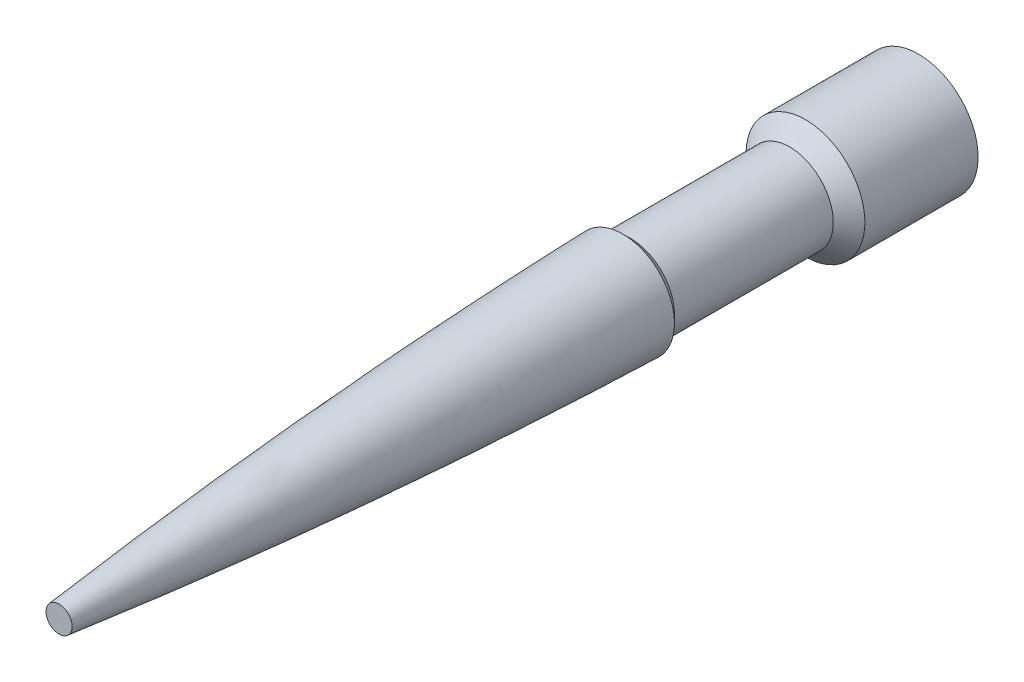
ISO-10303-21;
HEADER;
FILE_DESCRIPTION(('STEP AP214'),'2;1');
FILE_NAME('part.step','',(''),(''),'','','');
FILE_SCHEMA(('AUTOMOTIVE_DESIGN { 1 0 10303 214 1 1 1 1 }'));
ENDSEC;
DATA;
#1=APPLICATION_CONTEXT('core data for automotive mechanical design processes');
#2=APPLICATION_PROTOCOL_DEFINITION('international standard','automotive_design',2000,#1);
#3=PRODUCT_CONTEXT('',#1,'mechanical');
#4=PRODUCT('Part','Part','',(#3));
#5=PRODUCT_RELATED_PRODUCT_CATEGORY('part','',(#4));
#6=PRODUCT_DEFINITION_FORMATION('','',#4);
#7=PRODUCT_DEFINITION_CONTEXT('part definition',#1,'design');
#8=PRODUCT_DEFINITION('design','',#6,#7);
#9=PRODUCT_DEFINITION_SHAPE('','',#8);
#10=(LENGTH_UNIT() NAMED_UNIT(*) SI_UNIT(.MILLI.,.METRE.));
#11=(NAMED_UNIT(*) PLANE_ANGLE_UNIT() SI_UNIT($,.RADIAN.));
#12=(NAMED_UNIT(*) SI_UNIT($,.STERADIAN.) SOLID_ANGLE_UNIT());
#13=UNCERTAINTY_MEASURE_WITH_UNIT(LENGTH_MEASURE(1.E-05),#10,'distance_accuracy_value','');
#14=(GEOMETRIC_REPRESENTATION_CONTEXT(3) GLOBAL_UNCERTAINTY_ASSIGNED_CONTEXT((#13)) GLOBAL_UNIT_ASSIGNED_CONTEXT((#10,
#11,#12)) REPRESENTATION_CONTEXT('',''));
#15=CARTESIAN_POINT('',(0.,0.,0.));
#16=DIRECTION('',(0.,0.,1.));
#17=DIRECTION('',(1.,0.,0.));
#18=AXIS2_PLACEMENT_3D('',#15,#16,#17);
#19=CARTESIAN_POINT('',(0.,0.,0.));
#20=DIRECTION('',(0.,0.,1.));
#21=DIRECTION('',(1.,0.,0.));
#22=AXIS2_PLACEMENT_3D('',#19,#20,#21);
#23=PLANE('',#22);
#24=CARTESIAN_POINT('',(0.,0.,0.));
#25=DIRECTION('',(0.,0.,-1.));
#26=DIRECTION('',(-1.,0.,0.));
#27=AXIS2_PLACEMENT_3D('',#24,#25,#26);
#28=CIRCLE('',#27,7.49999999999998);
#29=CARTESIAN_POINT('',(-7.49999999999998,0.,0.));
#30=VERTEX_POINT('',#29);
#31=EDGE_CURVE('E75',#30,#30,#28,.T.);
#32=ORIENTED_EDGE('',*,*,#31,.T.);
#33=EDGE_LOOP('',(#32));
#34=FACE_BOUND('',#33,.T.);
#35=ADVANCED_FACE('F47',(#34),#23,.F.);
#36=CARTESIAN_POINT('',(0.,0.,108.493072776835));
#37=DIRECTION('',(0.,0.,-1.));
#38=DIRECTION('',(-1.,0.,0.));
#39=AXIS2_PLACEMENT_3D('',#36,#37,#38);
#40=PLANE('',#39);
#41=CARTESIAN_POINT('',(0.,0.,108.493072776835));
#42=DIRECTION('',(0.,0.,-1.));
#43=DIRECTION('',(-1.,0.,0.));
#44=AXIS2_PLACEMENT_3D('',#41,#42,#43);
#45=CIRCLE('',#44,1.64796304543771);
#46=CARTESIAN_POINT('',(-1.64796304543771,0.,108.493072776835));
#47=VERTEX_POINT('',#46);
#48=EDGE_CURVE('E10',#47,#47,#45,.T.);
#49=ORIENTED_EDGE('',*,*,#48,.F.);
#50=EDGE_LOOP('',(#49));
#51=FACE_BOUND('',#50,.T.);
#52=ADVANCED_FACE('F89',(#51),#40,.F.);
#53=CARTESIAN_POINT('',(1.64796304543771,0.,108.493072776835));
#54=CARTESIAN_POINT('',(5.54524245557787,0.,73.0165339564113));
#55=CARTESIAN_POINT('',(6.50411677118534,0.,37.3305737939415));
#56=B_SPLINE_CURVE_WITH_KNOTS('',2,(#53,#54,#55),.UNSPECIFIED.,.F.,.F.,(3,3),(0.,1.),.UNSPECIFIED.);
#57=CARTESIAN_POINT('',(0.,0.,0.));
#58=DIRECTION('',(0.,0.,-1.));
#59=AXIS1_PLACEMENT('',#57,#58);
#60=SURFACE_OF_REVOLUTION('',#56,#59);
#61=CARTESIAN_POINT('',(0.,0.,37.3305737939415));
#62=DIRECTION('',(0.,0.,-1.));
#63=DIRECTION('',(-1.,0.,0.));
#64=AXIS2_PLACEMENT_3D('',#61,#62,#63);
#65=CIRCLE('',#64,6.50411677118534);
#66=CARTESIAN_POINT('',(-6.50411677118534,0.,37.3305737939415));
#67=VERTEX_POINT('',#66);
#68=EDGE_CURVE('E54',#67,#67,#65,.T.);
#69=ORIENTED_EDGE('',*,*,#68,.F.);
#70=EDGE_LOOP('',(#69));
#71=FACE_BOUND('',#70,.T.);
#72=ORIENTED_EDGE('',*,*,#48,.T.);
#73=EDGE_LOOP('',(#72));
#74=FACE_BOUND('',#73,.T.);
#75=ADVANCED_FACE('F85',(#71,#74),#60,.T.);
#76=CARTESIAN_POINT('',(0.,0.,37.3305737939415));
#77=DIRECTION('',(0.,0.,1.));
#78=DIRECTION('',(1.,0.,0.));
#79=AXIS2_PLACEMENT_3D('',#76,#77,#78);
#80=CONICAL_SURFACE('',#79,6.50411677118534,0.785398163397434);
#81=CARTESIAN_POINT('',(0.,0.,36.3346905651269));
#82=DIRECTION('',(0.,0.,-1.));
#83=DIRECTION('',(-1.,0.,0.));
#84=AXIS2_PLACEMENT_3D('',#81,#82,#83);
#85=CIRCLE('',#84,5.50823354237079);
#86=CARTESIAN_POINT('',(-5.50823354237079,0.,36.3346905651269));
#87=VERTEX_POINT('',#86);
#88=EDGE_CURVE('E61',#87,#87,#85,.T.);
#89=ORIENTED_EDGE('',*,*,#88,.F.);
#90=EDGE_LOOP('',(#89));
#91=FACE_BOUND('',#90,.T.);
#92=ORIENTED_EDGE('',*,*,#68,.T.);
#93=EDGE_LOOP('',(#92));
#94=FACE_BOUND('',#93,.T.);
#95=ADVANCED_FACE('F88',(#91,#94),#80,.T.);
#96=CARTESIAN_POINT('',(0.,0.,0.));
#97=DIRECTION('',(0.,0.,-1.));
#98=DIRECTION('',(-1.,0.,0.));
#99=AXIS2_PLACEMENT_3D('',#96,#97,#98);
#100=CYLINDRICAL_SURFACE('',#99,5.5082335423708);
#101=CARTESIAN_POINT('',(0.,0.,16.2847412797661));
#102=DIRECTION('',(0.,0.,-1.));
#103=DIRECTION('',(-1.,0.,0.));
#104=AXIS2_PLACEMENT_3D('',#101,#102,#103);
#105=CIRCLE('',#104,5.50823354237082);
#106=CARTESIAN_POINT('',(-5.50823354237082,0.,16.2847412797661));
#107=VERTEX_POINT('',#106);
#108=EDGE_CURVE('E66',#107,#107,#105,.T.);
#109=ORIENTED_EDGE('',*,*,#108,.F.);
#110=EDGE_LOOP('',(#109));
#111=FACE_BOUND('',#110,.T.);
#112=ORIENTED_EDGE('',*,*,#88,.T.);
#113=EDGE_LOOP('',(#112));
#114=FACE_BOUND('',#113,.T.);
#115=ADVANCED_FACE('F109',(#111,#114),#100,.T.);
#116=CARTESIAN_POINT('',(0.,0.,16.2847412797661));
#117=DIRECTION('',(0.,0.,-1.));
#118=DIRECTION('',(-1.,0.,0.));
#119=AXIS2_PLACEMENT_3D('',#116,#117,#118);
#120=CONICAL_SURFACE('',#119,5.50823354237082,0.785398163397448);
#121=CARTESIAN_POINT('',(0.,0.,14.2929748221369));
#122=DIRECTION('',(0.,0.,-1.));
#123=DIRECTION('',(-1.,0.,0.));
#124=AXIS2_PLACEMENT_3D('',#121,#122,#123);
#125=CIRCLE('',#124,7.50000000000003);
#126=CARTESIAN_POINT('',(-7.50000000000003,0.,14.2929748221369));
#127=VERTEX_POINT('',#126);
#128=EDGE_CURVE('E71',#127,#127,#125,.T.);
#129=ORIENTED_EDGE('',*,*,#128,.F.);
#130=EDGE_LOOP('',(#129));
#131=FACE_BOUND('',#130,.T.);
#132=ORIENTED_EDGE('',*,*,#108,.T.);
#133=EDGE_LOOP('',(#132));
#134=FACE_BOUND('',#133,.T.);
#135=ADVANCED_FACE('F103',(#131,#134),#120,.T.);
#136=CARTESIAN_POINT('',(0.,0.,0.));
#137=DIRECTION('',(0.,0.,-1.));
#138=DIRECTION('',(-1.,0.,0.));
#139=AXIS2_PLACEMENT_3D('',#136,#137,#138);
#140=CYLINDRICAL_SURFACE('',#139,7.50000000000001);
#141=ORIENTED_EDGE('',*,*,#31,.F.);
#142=EDGE_LOOP('',(#141));
#143=FACE_BOUND('',#142,.T.);
#144=ORIENTED_EDGE('',*,*,#128,.T.);
#145=EDGE_LOOP('',(#144));
#146=FACE_BOUND('',#145,.T.);
#147=ADVANCED_FACE('F100',(#143,#146),#140,.T.);
#148=CLOSED_SHELL('',(#35,#52,#75,#95,#115,#135,#147));
#149=MANIFOLD_SOLID_BREP('B2',#148);
#150=ADVANCED_BREP_SHAPE_REPRESENTATION('',(#18,#149),#14);
#151=SHAPE_DEFINITION_REPRESENTATION(#9,#150);
ENDSEC;
END-ISO-10303-21;
